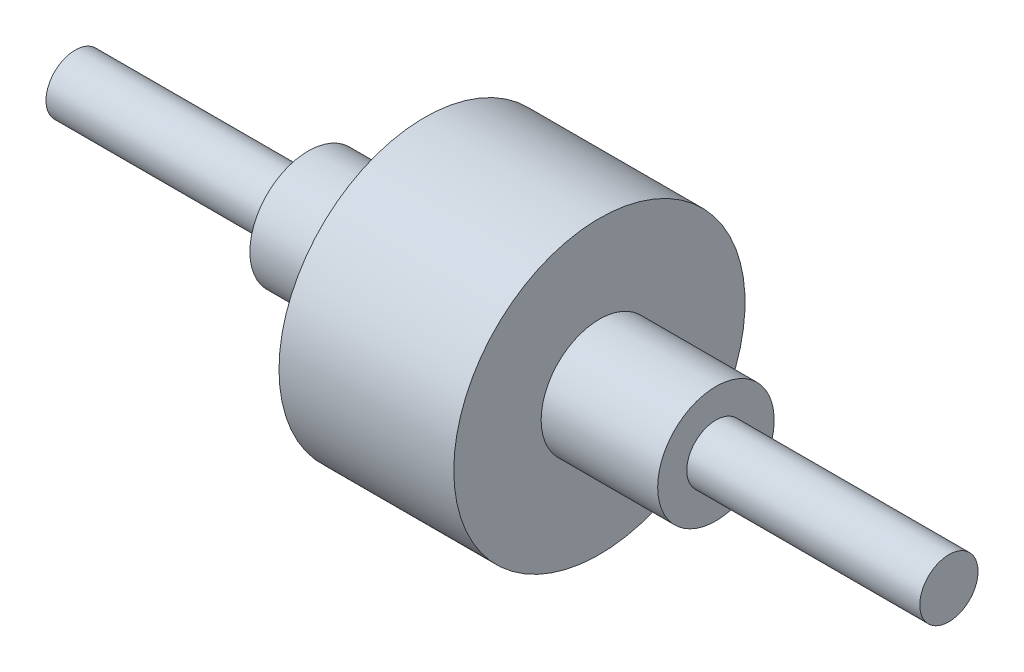
ISO-10303-21;
HEADER;
FILE_DESCRIPTION(('STEP AP214'),'2;1');
FILE_NAME('part.step','',(''),(''),'','','');
FILE_SCHEMA(('AUTOMOTIVE_DESIGN { 1 0 10303 214 1 1 1 1 }'));
ENDSEC;
DATA;
#1=APPLICATION_CONTEXT('core data for automotive mechanical design processes');
#2=APPLICATION_PROTOCOL_DEFINITION('international standard','automotive_design',2000,#1);
#3=PRODUCT_CONTEXT('',#1,'mechanical');
#4=PRODUCT('Part','Part','',(#3));
#5=PRODUCT_RELATED_PRODUCT_CATEGORY('part','',(#4));
#6=PRODUCT_DEFINITION_FORMATION('','',#4);
#7=PRODUCT_DEFINITION_CONTEXT('part definition',#1,'design');
#8=PRODUCT_DEFINITION('design','',#6,#7);
#9=PRODUCT_DEFINITION_SHAPE('','',#8);
#10=(LENGTH_UNIT() NAMED_UNIT(*) SI_UNIT(.MILLI.,.METRE.));
#11=(NAMED_UNIT(*) PLANE_ANGLE_UNIT() SI_UNIT($,.RADIAN.));
#12=(NAMED_UNIT(*) SI_UNIT($,.STERADIAN.) SOLID_ANGLE_UNIT());
#13=UNCERTAINTY_MEASURE_WITH_UNIT(LENGTH_MEASURE(1.E-05),#10,'distance_accuracy_value','');
#14=(GEOMETRIC_REPRESENTATION_CONTEXT(3) GLOBAL_UNCERTAINTY_ASSIGNED_CONTEXT((#13)) GLOBAL_UNIT_ASSIGNED_CONTEXT((#10,
#11,#12)) REPRESENTATION_CONTEXT('',''));
#15=CARTESIAN_POINT('',(0.,0.,0.));
#16=DIRECTION('',(0.,0.,1.));
#17=DIRECTION('',(1.,0.,0.));
#18=AXIS2_PLACEMENT_3D('',#15,#16,#17);
#19=CARTESIAN_POINT('',(150.,0.,0.));
#20=DIRECTION('',(-1.,0.,0.));
#21=DIRECTION('',(0.,0.,1.));
#22=AXIS2_PLACEMENT_3D('',#19,#20,#21);
#23=PLANE('',#22);
#24=CARTESIAN_POINT('',(150.,0.,0.));
#25=DIRECTION('',(-1.,0.,0.));
#26=DIRECTION('',(0.,0.,1.));
#27=AXIS2_PLACEMENT_3D('',#24,#25,#26);
#28=CIRCLE('',#27,10.);
#29=CARTESIAN_POINT('',(150.,0.,10.));
#30=VERTEX_POINT('',#29);
#31=EDGE_CURVE('E10',#30,#30,#28,.T.);
#32=ORIENTED_EDGE('',*,*,#31,.F.);
#33=EDGE_LOOP('',(#32));
#34=FACE_BOUND('',#33,.T.);
#35=ADVANCED_FACE('F39',(#34),#23,.F.);
#36=CARTESIAN_POINT('',(-150.,0.,0.));
#37=DIRECTION('',(-1.,0.,0.));
#38=DIRECTION('',(0.,0.,1.));
#39=AXIS2_PLACEMENT_3D('',#36,#37,#38);
#40=CYLINDRICAL_SURFACE('',#39,9.99999999999999);
#41=CARTESIAN_POINT('',(70.,0.,0.));
#42=DIRECTION('',(-1.,0.,0.));
#43=DIRECTION('',(0.,0.,1.));
#44=AXIS2_PLACEMENT_3D('',#41,#42,#43);
#45=CIRCLE('',#44,9.99999999999999);
#46=CARTESIAN_POINT('',(70.,0.,9.99999999999999));
#47=VERTEX_POINT('',#46);
#48=EDGE_CURVE('E45',#47,#47,#45,.T.);
#49=ORIENTED_EDGE('',*,*,#48,.F.);
#50=EDGE_LOOP('',(#49));
#51=FACE_BOUND('',#50,.T.);
#52=ORIENTED_EDGE('',*,*,#31,.T.);
#53=EDGE_LOOP('',(#52));
#54=FACE_BOUND('',#53,.T.);
#55=ADVANCED_FACE('F123',(#51,#54),#40,.T.);
#56=CARTESIAN_POINT('',(70.,9.99999999999999,0.));
#57=DIRECTION('',(-1.,0.,0.));
#58=DIRECTION('',(0.,0.,1.));
#59=AXIS2_PLACEMENT_3D('',#56,#57,#58);
#60=PLANE('',#59);
#61=CARTESIAN_POINT('',(70.,0.,0.));
#62=DIRECTION('',(-1.,0.,0.));
#63=DIRECTION('',(0.,0.,1.));
#64=AXIS2_PLACEMENT_3D('',#61,#62,#63);
#65=CIRCLE('',#64,20.);
#66=CARTESIAN_POINT('',(70.,0.,20.));
#67=VERTEX_POINT('',#66);
#68=EDGE_CURVE('E49',#67,#67,#65,.T.);
#69=ORIENTED_EDGE('',*,*,#68,.F.);
#70=EDGE_LOOP('',(#69));
#71=FACE_BOUND('',#70,.T.);
#72=ORIENTED_EDGE('',*,*,#48,.T.);
#73=EDGE_LOOP('',(#72));
#74=FACE_BOUND('',#73,.T.);
#75=ADVANCED_FACE('F118',(#71,#74),#60,.F.);
#76=CARTESIAN_POINT('',(-150.,0.,0.));
#77=DIRECTION('',(-1.,0.,0.));
#78=DIRECTION('',(0.,0.,1.));
#79=AXIS2_PLACEMENT_3D('',#76,#77,#78);
#80=CYLINDRICAL_SURFACE('',#79,20.);
#81=CARTESIAN_POINT('',(30.,0.,0.));
#82=DIRECTION('',(-1.,0.,0.));
#83=DIRECTION('',(0.,0.,1.));
#84=AXIS2_PLACEMENT_3D('',#81,#82,#83);
#85=CIRCLE('',#84,20.);
#86=CARTESIAN_POINT('',(30.,0.,20.));
#87=VERTEX_POINT('',#86);
#88=EDGE_CURVE('E53',#87,#87,#85,.T.);
#89=ORIENTED_EDGE('',*,*,#88,.F.);
#90=EDGE_LOOP('',(#89));
#91=FACE_BOUND('',#90,.T.);
#92=ORIENTED_EDGE('',*,*,#68,.T.);
#93=EDGE_LOOP('',(#92));
#94=FACE_BOUND('',#93,.T.);
#95=ADVANCED_FACE('F112',(#91,#94),#80,.T.);
#96=CARTESIAN_POINT('',(30.,20.,0.));
#97=DIRECTION('',(-1.,0.,0.));
#98=DIRECTION('',(0.,0.,1.));
#99=AXIS2_PLACEMENT_3D('',#96,#97,#98);
#100=PLANE('',#99);
#101=CARTESIAN_POINT('',(30.,0.,0.));
#102=DIRECTION('',(-1.,0.,0.));
#103=DIRECTION('',(0.,0.,1.));
#104=AXIS2_PLACEMENT_3D('',#101,#102,#103);
#105=CIRCLE('',#104,50.);
#106=CARTESIAN_POINT('',(30.,0.,50.));
#107=VERTEX_POINT('',#106);
#108=EDGE_CURVE('E58',#107,#107,#105,.T.);
#109=ORIENTED_EDGE('',*,*,#108,.F.);
#110=EDGE_LOOP('',(#109));
#111=FACE_BOUND('',#110,.T.);
#112=ORIENTED_EDGE('',*,*,#88,.T.);
#113=EDGE_LOOP('',(#112));
#114=FACE_BOUND('',#113,.T.);
#115=ADVANCED_FACE('F106',(#111,#114),#100,.F.);
#116=CARTESIAN_POINT('',(-150.,0.,0.));
#117=DIRECTION('',(-1.,0.,0.));
#118=DIRECTION('',(0.,0.,1.));
#119=AXIS2_PLACEMENT_3D('',#116,#117,#118);
#120=CYLINDRICAL_SURFACE('',#119,50.);
#121=CARTESIAN_POINT('',(-30.,0.,0.));
#122=DIRECTION('',(-1.,0.,0.));
#123=DIRECTION('',(0.,0.,1.));
#124=AXIS2_PLACEMENT_3D('',#121,#122,#123);
#125=CIRCLE('',#124,50.);
#126=CARTESIAN_POINT('',(-30.,0.,50.));
#127=VERTEX_POINT('',#126);
#128=EDGE_CURVE('E61',#127,#127,#125,.T.);
#129=ORIENTED_EDGE('',*,*,#128,.F.);
#130=EDGE_LOOP('',(#129));
#131=FACE_BOUND('',#130,.T.);
#132=ORIENTED_EDGE('',*,*,#108,.T.);
#133=EDGE_LOOP('',(#132));
#134=FACE_BOUND('',#133,.T.);
#135=ADVANCED_FACE('F100',(#131,#134),#120,.T.);
#136=CARTESIAN_POINT('',(-30.,20.,0.));
#137=DIRECTION('',(1.,0.,0.));
#138=DIRECTION('',(0.,0.,-1.));
#139=AXIS2_PLACEMENT_3D('',#136,#137,#138);
#140=PLANE('',#139);
#141=CARTESIAN_POINT('',(-30.,0.,0.));
#142=DIRECTION('',(-1.,0.,0.));
#143=DIRECTION('',(0.,0.,1.));
#144=AXIS2_PLACEMENT_3D('',#141,#142,#143);
#145=CIRCLE('',#144,20.);
#146=CARTESIAN_POINT('',(-30.,0.,20.));
#147=VERTEX_POINT('',#146);
#148=EDGE_CURVE('E64',#147,#147,#145,.T.);
#149=ORIENTED_EDGE('',*,*,#148,.F.);
#150=EDGE_LOOP('',(#149));
#151=FACE_BOUND('',#150,.T.);
#152=ORIENTED_EDGE('',*,*,#128,.T.);
#153=EDGE_LOOP('',(#152));
#154=FACE_BOUND('',#153,.T.);
#155=ADVANCED_FACE('F94',(#151,#154),#140,.F.);
#156=CARTESIAN_POINT('',(-150.,0.,0.));
#157=DIRECTION('',(-1.,0.,0.));
#158=DIRECTION('',(0.,0.,1.));
#159=AXIS2_PLACEMENT_3D('',#156,#157,#158);
#160=CYLINDRICAL_SURFACE('',#159,20.);
#161=CARTESIAN_POINT('',(-70.,0.,0.));
#162=DIRECTION('',(-1.,0.,0.));
#163=DIRECTION('',(0.,0.,1.));
#164=AXIS2_PLACEMENT_3D('',#161,#162,#163);
#165=CIRCLE('',#164,20.);
#166=CARTESIAN_POINT('',(-70.,0.,20.));
#167=VERTEX_POINT('',#166);
#168=EDGE_CURVE('E67',#167,#167,#165,.T.);
#169=ORIENTED_EDGE('',*,*,#168,.F.);
#170=EDGE_LOOP('',(#169));
#171=FACE_BOUND('',#170,.T.);
#172=ORIENTED_EDGE('',*,*,#148,.T.);
#173=EDGE_LOOP('',(#172));
#174=FACE_BOUND('',#173,.T.);
#175=ADVANCED_FACE('F88',(#171,#174),#160,.T.);
#176=CARTESIAN_POINT('',(-70.,9.99999999999999,0.));
#177=DIRECTION('',(1.,0.,0.));
#178=DIRECTION('',(0.,0.,-1.));
#179=AXIS2_PLACEMENT_3D('',#176,#177,#178);
#180=PLANE('',#179);
#181=CARTESIAN_POINT('',(-70.,0.,0.));
#182=DIRECTION('',(-1.,0.,0.));
#183=DIRECTION('',(0.,0.,1.));
#184=AXIS2_PLACEMENT_3D('',#181,#182,#183);
#185=CIRCLE('',#184,9.99999999999999);
#186=CARTESIAN_POINT('',(-70.,0.,9.99999999999999));
#187=VERTEX_POINT('',#186);
#188=EDGE_CURVE('E70',#187,#187,#185,.T.);
#189=ORIENTED_EDGE('',*,*,#188,.F.);
#190=EDGE_LOOP('',(#189));
#191=FACE_BOUND('',#190,.T.);
#192=ORIENTED_EDGE('',*,*,#168,.T.);
#193=EDGE_LOOP('',(#192));
#194=FACE_BOUND('',#193,.T.);
#195=ADVANCED_FACE('F82',(#191,#194),#180,.F.);
#196=CARTESIAN_POINT('',(-150.,0.,0.));
#197=DIRECTION('',(-1.,0.,0.));
#198=DIRECTION('',(0.,0.,1.));
#199=AXIS2_PLACEMENT_3D('',#196,#197,#198);
#200=CYLINDRICAL_SURFACE('',#199,9.99999999999999);
#201=CARTESIAN_POINT('',(-150.,0.,0.));
#202=DIRECTION('',(-1.,0.,0.));
#203=DIRECTION('',(0.,0.,1.));
#204=AXIS2_PLACEMENT_3D('',#201,#202,#203);
#205=CIRCLE('',#204,10.);
#206=CARTESIAN_POINT('',(-150.,0.,10.));
#207=VERTEX_POINT('',#206);
#208=EDGE_CURVE('E73',#207,#207,#205,.T.);
#209=ORIENTED_EDGE('',*,*,#208,.F.);
#210=EDGE_LOOP('',(#209));
#211=FACE_BOUND('',#210,.T.);
#212=ORIENTED_EDGE('',*,*,#188,.T.);
#213=EDGE_LOOP('',(#212));
#214=FACE_BOUND('',#213,.T.);
#215=ADVANCED_FACE('F79',(#211,#214),#200,.T.);
#216=CARTESIAN_POINT('',(-150.,0.,0.));
#217=DIRECTION('',(1.,0.,0.));
#218=DIRECTION('',(0.,0.,-1.));
#219=AXIS2_PLACEMENT_3D('',#216,#217,#218);
#220=PLANE('',#219);
#221=ORIENTED_EDGE('',*,*,#208,.T.);
#222=EDGE_LOOP('',(#221));
#223=FACE_BOUND('',#222,.T.);
#224=ADVANCED_FACE('F77',(#223),#220,.F.);
#225=CLOSED_SHELL('',(#35,#55,#75,#95,#115,#135,#155,#175,#195,#215,#224));
#226=MANIFOLD_SOLID_BREP('B2',#225);
#227=ADVANCED_BREP_SHAPE_REPRESENTATION('',(#18,#226),#14);
#228=SHAPE_DEFINITION_REPRESENTATION(#9,#227);
ENDSEC;
END-ISO-10303-21;
